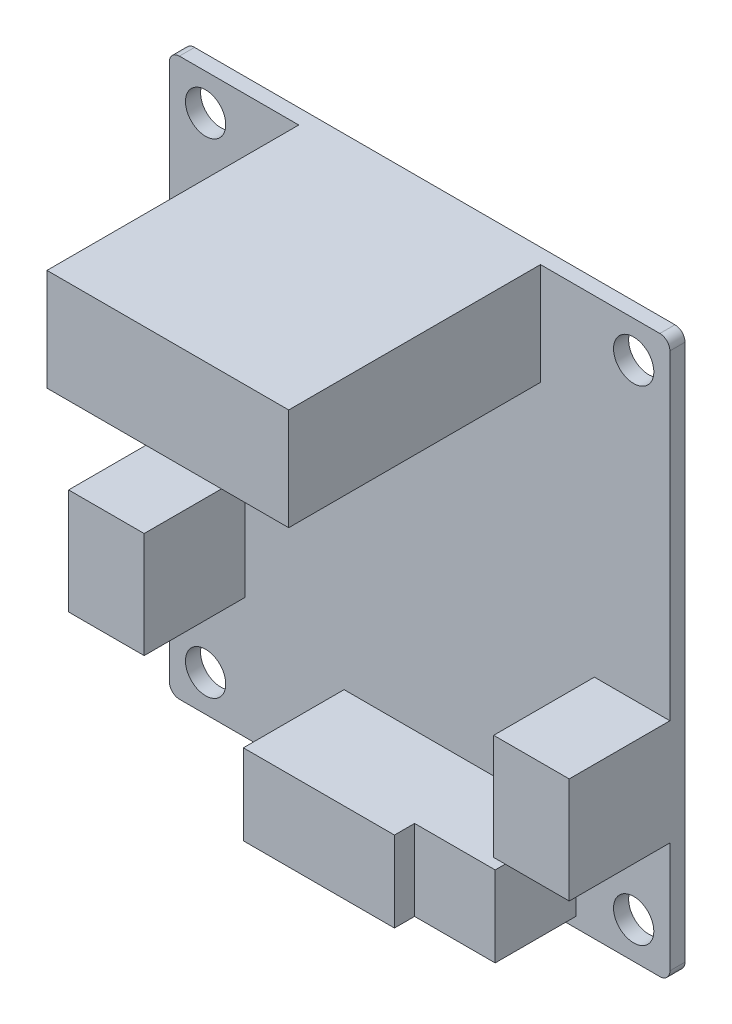
ISO-10303-21;
HEADER;
FILE_DESCRIPTION(('STEP AP214'),'2;1');
FILE_NAME('part.step','',(''),(''),'','','');
FILE_SCHEMA(('AUTOMOTIVE_DESIGN { 1 0 10303 214 1 1 1 1 }'));
ENDSEC;
DATA;
#1=APPLICATION_CONTEXT('core data for automotive mechanical design processes');
#2=APPLICATION_PROTOCOL_DEFINITION('international standard','automotive_design',2000,#1);
#3=PRODUCT_CONTEXT('',#1,'mechanical');
#4=PRODUCT('Part','Part','',(#3));
#5=PRODUCT_RELATED_PRODUCT_CATEGORY('part','',(#4));
#6=PRODUCT_DEFINITION_FORMATION('','',#4);
#7=PRODUCT_DEFINITION_CONTEXT('part definition',#1,'design');
#8=PRODUCT_DEFINITION('design','',#6,#7);
#9=PRODUCT_DEFINITION_SHAPE('','',#8);
#10=(LENGTH_UNIT() NAMED_UNIT(*) SI_UNIT(.MILLI.,.METRE.));
#11=(NAMED_UNIT(*) PLANE_ANGLE_UNIT() SI_UNIT($,.RADIAN.));
#12=(NAMED_UNIT(*) SI_UNIT($,.STERADIAN.) SOLID_ANGLE_UNIT());
#13=UNCERTAINTY_MEASURE_WITH_UNIT(LENGTH_MEASURE(1.E-05),#10,'distance_accuracy_value','');
#14=(GEOMETRIC_REPRESENTATION_CONTEXT(3) GLOBAL_UNCERTAINTY_ASSIGNED_CONTEXT((#13)) GLOBAL_UNIT_ASSIGNED_CONTEXT((#10,
#11,#12)) REPRESENTATION_CONTEXT('',''));
#15=CARTESIAN_POINT('',(0.,0.,0.));
#16=DIRECTION('',(0.,0.,1.));
#17=DIRECTION('',(1.,0.,0.));
#18=AXIS2_PLACEMENT_3D('',#15,#16,#17);
#19=CARTESIAN_POINT('',(0.,0.,1.5));
#20=DIRECTION('',(0.,0.,-1.));
#21=DIRECTION('',(-1.,0.,0.));
#22=AXIS2_PLACEMENT_3D('',#19,#20,#21);
#23=PLANE('',#22);
#24=CARTESIAN_POINT('',(3.6,3.6,1.5));
#25=DIRECTION('',(0.,0.,1.));
#26=DIRECTION('',(-1.,0.,0.));
#27=AXIS2_PLACEMENT_3D('',#24,#25,#26);
#28=CIRCLE('',#27,2.);
#29=CARTESIAN_POINT('',(1.6,3.6,1.5));
#30=VERTEX_POINT('',#29);
#31=EDGE_CURVE('E430',#30,#30,#28,.T.);
#32=ORIENTED_EDGE('',*,*,#31,.F.);
#33=EDGE_LOOP('',(#32));
#34=FACE_BOUND('',#33,.T.);
#35=CARTESIAN_POINT('',(46.1,51.7,1.5));
#36=DIRECTION('',(0.,0.,1.));
#37=DIRECTION('',(-1.,0.,0.));
#38=AXIS2_PLACEMENT_3D('',#35,#36,#37);
#39=CIRCLE('',#38,2.);
#40=CARTESIAN_POINT('',(44.1,51.7,1.5));
#41=VERTEX_POINT('',#40);
#42=EDGE_CURVE('E418',#41,#41,#39,.T.);
#43=ORIENTED_EDGE('',*,*,#42,.F.);
#44=EDGE_LOOP('',(#43));
#45=FACE_BOUND('',#44,.T.);
#46=CARTESIAN_POINT('',(3.6,51.7,1.5));
#47=DIRECTION('',(0.,0.,1.));
#48=DIRECTION('',(1.,0.,0.));
#49=AXIS2_PLACEMENT_3D('',#46,#47,#48);
#50=CIRCLE('',#49,2.);
#51=CARTESIAN_POINT('',(5.6,51.7,1.5));
#52=VERTEX_POINT('',#51);
#53=EDGE_CURVE('E352',#52,#52,#50,.T.);
#54=ORIENTED_EDGE('',*,*,#53,.F.);
#55=EDGE_LOOP('',(#54));
#56=FACE_BOUND('',#55,.T.);
#57=CARTESIAN_POINT('',(46.1,3.6,1.5));
#58=DIRECTION('',(0.,0.,1.));
#59=DIRECTION('',(1.,0.,0.));
#60=AXIS2_PLACEMENT_3D('',#57,#58,#59);
#61=CIRCLE('',#60,2.);
#62=CARTESIAN_POINT('',(48.1,3.6,1.5));
#63=VERTEX_POINT('',#62);
#64=EDGE_CURVE('E424',#63,#63,#61,.T.);
#65=ORIENTED_EDGE('',*,*,#64,.F.);
#66=EDGE_LOOP('',(#65));
#67=FACE_BOUND('',#66,.T.);
#68=DIRECTION('',(1.,0.,0.));
#69=VECTOR('',#68,1.);
#70=CARTESIAN_POINT('',(49.7,12.,1.5));
#71=LINE('',#70,#69);
#72=CARTESIAN_POINT('',(42.2,12.,1.5));
#73=VERTEX_POINT('',#72);
#74=CARTESIAN_POINT('',(49.7,12.,1.5));
#75=VERTEX_POINT('',#74);
#76=EDGE_CURVE('E58',#73,#75,#71,.T.);
#77=ORIENTED_EDGE('',*,*,#76,.F.);
#78=DIRECTION('',(0.,-1.,0.));
#79=VECTOR('',#78,1.);
#80=CARTESIAN_POINT('',(42.2,12.,1.5));
#81=LINE('',#80,#79);
#82=CARTESIAN_POINT('',(42.2,22.5,1.5));
#83=VERTEX_POINT('',#82);
#84=EDGE_CURVE('E244',#83,#73,#81,.T.);
#85=ORIENTED_EDGE('',*,*,#84,.F.);
#86=DIRECTION('',(-1.,0.,0.));
#87=VECTOR('',#86,1.);
#88=CARTESIAN_POINT('',(49.7,22.5,1.5));
#89=LINE('',#88,#87);
#90=CARTESIAN_POINT('',(49.7,22.5,1.5));
#91=VERTEX_POINT('',#90);
#92=EDGE_CURVE('E252',#91,#83,#89,.T.);
#93=ORIENTED_EDGE('',*,*,#92,.F.);
#94=DIRECTION('',(0.,1.,0.));
#95=VECTOR('',#94,1.);
#96=CARTESIAN_POINT('',(49.7,0.,1.5));
#97=LINE('',#96,#95);
#98=CARTESIAN_POINT('',(49.7,54.3,1.5));
#99=VERTEX_POINT('',#98);
#100=EDGE_CURVE('E413',#91,#99,#97,.T.);
#101=ORIENTED_EDGE('',*,*,#100,.T.);
#102=CARTESIAN_POINT('',(48.7,54.3,1.5));
#103=DIRECTION('',(0.,0.,-1.));
#104=DIRECTION('',(-1.,0.,0.));
#105=AXIS2_PLACEMENT_3D('',#102,#103,#104);
#106=CIRCLE('',#105,1.);
#107=CARTESIAN_POINT('',(48.7,55.3,1.5));
#108=VERTEX_POINT('',#107);
#109=EDGE_CURVE('E383',#99,#108,#106,.F.);
#110=ORIENTED_EDGE('',*,*,#109,.T.);
#111=DIRECTION('',(-1.,0.,0.));
#112=VECTOR('',#111,1.);
#113=CARTESIAN_POINT('',(0.,55.3,1.5));
#114=LINE('',#113,#112);
#115=CARTESIAN_POINT('',(36.85,55.3,1.5));
#116=VERTEX_POINT('',#115);
#117=EDGE_CURVE('E341',#108,#116,#114,.T.);
#118=ORIENTED_EDGE('',*,*,#117,.T.);
#119=DIRECTION('',(0.,1.,0.));
#120=VECTOR('',#119,1.);
#121=CARTESIAN_POINT('',(36.85,45.172543808363,1.5));
#122=LINE('',#121,#120);
#123=CARTESIAN_POINT('',(36.85,45.172543808363,1.5));
#124=VERTEX_POINT('',#123);
#125=EDGE_CURVE('E302',#124,#116,#122,.T.);
#126=ORIENTED_EDGE('',*,*,#125,.F.);
#127=DIRECTION('',(1.,0.,0.));
#128=VECTOR('',#127,1.);
#129=CARTESIAN_POINT('',(12.85,45.172543808363,1.5));
#130=LINE('',#129,#128);
#131=CARTESIAN_POINT('',(12.85,45.172543808363,1.5));
#132=VERTEX_POINT('',#131);
#133=EDGE_CURVE('E309',#132,#124,#130,.T.);
#134=ORIENTED_EDGE('',*,*,#133,.F.);
#135=DIRECTION('',(0.,-1.,0.));
#136=VECTOR('',#135,1.);
#137=CARTESIAN_POINT('',(12.85,45.172543808363,1.5));
#138=LINE('',#137,#136);
#139=CARTESIAN_POINT('',(12.85,55.3,1.5));
#140=VERTEX_POINT('',#139);
#141=EDGE_CURVE('E297',#140,#132,#138,.T.);
#142=ORIENTED_EDGE('',*,*,#141,.F.);
#143=CARTESIAN_POINT('',(1.,55.3,1.5));
#144=VERTEX_POINT('',#143);
#145=EDGE_CURVE('E338',#140,#144,#114,.T.);
#146=ORIENTED_EDGE('',*,*,#145,.T.);
#147=CARTESIAN_POINT('',(1.,54.3,1.5));
#148=DIRECTION('',(0.,0.,-1.));
#149=DIRECTION('',(-1.,0.,0.));
#150=AXIS2_PLACEMENT_3D('',#147,#148,#149);
#151=CIRCLE('',#150,1.);
#152=CARTESIAN_POINT('',(0.,54.3,1.5));
#153=VERTEX_POINT('',#152);
#154=EDGE_CURVE('E381',#144,#153,#151,.F.);
#155=ORIENTED_EDGE('',*,*,#154,.T.);
#156=DIRECTION('',(0.,-1.,0.));
#157=VECTOR('',#156,1.);
#158=CARTESIAN_POINT('',(0.,0.,1.5));
#159=LINE('',#158,#157);
#160=CARTESIAN_POINT('',(0.,22.5,1.5));
#161=VERTEX_POINT('',#160);
#162=EDGE_CURVE('E404',#153,#161,#159,.T.);
#163=ORIENTED_EDGE('',*,*,#162,.T.);
#164=DIRECTION('',(-1.,0.,0.));
#165=VECTOR('',#164,1.);
#166=CARTESIAN_POINT('',(0.,22.5,1.5));
#167=LINE('',#166,#165);
#168=CARTESIAN_POINT('',(7.5,22.5,1.5));
#169=VERTEX_POINT('',#168);
#170=EDGE_CURVE('E272',#169,#161,#167,.T.);
#171=ORIENTED_EDGE('',*,*,#170,.F.);
#172=DIRECTION('',(0.,1.,0.));
#173=VECTOR('',#172,1.);
#174=CARTESIAN_POINT('',(7.5,12.,1.5));
#175=LINE('',#174,#173);
#176=CARTESIAN_POINT('',(7.5,12.,1.5));
#177=VERTEX_POINT('',#176);
#178=EDGE_CURVE('E281',#177,#169,#175,.T.);
#179=ORIENTED_EDGE('',*,*,#178,.F.);
#180=DIRECTION('',(1.,0.,0.));
#181=VECTOR('',#180,1.);
#182=CARTESIAN_POINT('',(0.,12.,1.5));
#183=LINE('',#182,#181);
#184=CARTESIAN_POINT('',(0.,12.,1.5));
#185=VERTEX_POINT('',#184);
#186=EDGE_CURVE('E267',#185,#177,#183,.T.);
#187=ORIENTED_EDGE('',*,*,#186,.F.);
#188=CARTESIAN_POINT('',(0.,1.,1.5));
#189=VERTEX_POINT('',#188);
#190=EDGE_CURVE('E361',#185,#189,#159,.T.);
#191=ORIENTED_EDGE('',*,*,#190,.T.);
#192=CARTESIAN_POINT('',(1.,1.,1.5));
#193=DIRECTION('',(0.,0.,-1.));
#194=DIRECTION('',(-1.,0.,0.));
#195=AXIS2_PLACEMENT_3D('',#192,#193,#194);
#196=CIRCLE('',#195,1.);
#197=CARTESIAN_POINT('',(1.,0.,1.5));
#198=VERTEX_POINT('',#197);
#199=EDGE_CURVE('E387',#189,#198,#196,.F.);
#200=ORIENTED_EDGE('',*,*,#199,.T.);
#201=DIRECTION('',(1.,0.,0.));
#202=VECTOR('',#201,1.);
#203=CARTESIAN_POINT('',(0.,0.,1.5));
#204=LINE('',#203,#202);
#205=CARTESIAN_POINT('',(48.7,0.,1.5));
#206=VERTEX_POINT('',#205);
#207=EDGE_CURVE('E410',#198,#206,#204,.T.);
#208=ORIENTED_EDGE('',*,*,#207,.T.);
#209=CARTESIAN_POINT('',(48.7,1.,1.5));
#210=DIRECTION('',(0.,0.,-1.));
#211=DIRECTION('',(-1.,0.,0.));
#212=AXIS2_PLACEMENT_3D('',#209,#210,#211);
#213=CIRCLE('',#212,1.);
#214=CARTESIAN_POINT('',(49.7,1.,1.5));
#215=VERTEX_POINT('',#214);
#216=EDGE_CURVE('E385',#206,#215,#213,.F.);
#217=ORIENTED_EDGE('',*,*,#216,.T.);
#218=EDGE_CURVE('E342',#215,#75,#97,.T.);
#219=ORIENTED_EDGE('',*,*,#218,.T.);
#220=EDGE_LOOP('',(#77,#85,#93,#101,#110,#118,#126,#134,#142,#146,#155,#163,#171,#179,#187,#191,
#200,#208,#217,#219));
#221=FACE_BOUND('',#220,.T.);
#222=DIRECTION('',(0.,1.,0.));
#223=VECTOR('',#222,1.);
#224=CARTESIAN_POINT('',(40.35,0.999999999999999,1.5));
#225=LINE('',#224,#223);
#226=CARTESIAN_POINT('',(40.35,0.999999999999999,1.5));
#227=VERTEX_POINT('',#226);
#228=CARTESIAN_POINT('',(40.35,9.,1.5));
#229=VERTEX_POINT('',#228);
#230=EDGE_CURVE('E228',#227,#229,#225,.T.);
#231=ORIENTED_EDGE('',*,*,#230,.F.);
#232=DIRECTION('',(1.,0.,0.));
#233=VECTOR('',#232,1.);
#234=CARTESIAN_POINT('',(17.35,0.999999999999999,1.5));
#235=LINE('',#234,#233);
#236=CARTESIAN_POINT('',(17.35,0.999999999999999,1.5));
#237=VERTEX_POINT('',#236);
#238=EDGE_CURVE('E50',#237,#227,#235,.T.);
#239=ORIENTED_EDGE('',*,*,#238,.F.);
#240=DIRECTION('',(0.,-1.,0.));
#241=VECTOR('',#240,1.);
#242=CARTESIAN_POINT('',(17.35,0.999999999999999,1.5));
#243=LINE('',#242,#241);
#244=CARTESIAN_POINT('',(17.35,9.,1.5));
#245=VERTEX_POINT('',#244);
#246=EDGE_CURVE('E670',#245,#237,#243,.T.);
#247=ORIENTED_EDGE('',*,*,#246,.F.);
#248=DIRECTION('',(-1.,0.,0.));
#249=VECTOR('',#248,1.);
#250=CARTESIAN_POINT('',(17.35,9.,1.5));
#251=LINE('',#250,#249);
#252=EDGE_CURVE('E667',#229,#245,#251,.T.);
#253=ORIENTED_EDGE('',*,*,#252,.F.);
#254=EDGE_LOOP('',(#231,#239,#247,#253));
#255=FACE_BOUND('',#254,.T.);
#256=ADVANCED_FACE('F33',(#34,#45,#56,#67,#221,#255),#23,.F.);
#257=CARTESIAN_POINT('',(32.35,0.999999999999999,11.5));
#258=DIRECTION('',(-1.,0.,0.));
#259=DIRECTION('',(0.,0.,1.));
#260=AXIS2_PLACEMENT_3D('',#257,#258,#259);
#261=PLANE('',#260);
#262=DIRECTION('',(0.,-1.,0.));
#263=VECTOR('',#262,1.);
#264=CARTESIAN_POINT('',(32.35,0.999999999999999,9.5));
#265=LINE('',#264,#263);
#266=CARTESIAN_POINT('',(32.35,9.,9.5));
#267=VERTEX_POINT('',#266);
#268=CARTESIAN_POINT('',(32.35,0.999999999999999,9.5));
#269=VERTEX_POINT('',#268);
#270=EDGE_CURVE('E219',#267,#269,#265,.T.);
#271=ORIENTED_EDGE('',*,*,#270,.F.);
#272=DIRECTION('',(0.,0.,-1.));
#273=VECTOR('',#272,1.);
#274=CARTESIAN_POINT('',(32.35,9.,11.5));
#275=LINE('',#274,#273);
#276=CARTESIAN_POINT('',(32.35,9.,11.5));
#277=VERTEX_POINT('',#276);
#278=EDGE_CURVE('E233',#277,#267,#275,.T.);
#279=ORIENTED_EDGE('',*,*,#278,.F.);
#280=DIRECTION('',(0.,1.,0.));
#281=VECTOR('',#280,1.);
#282=CARTESIAN_POINT('',(32.35,0.999999999999999,11.5));
#283=LINE('',#282,#281);
#284=CARTESIAN_POINT('',(32.35,0.999999999999999,11.5));
#285=VERTEX_POINT('',#284);
#286=EDGE_CURVE('E231',#285,#277,#283,.T.);
#287=ORIENTED_EDGE('',*,*,#286,.F.);
#288=DIRECTION('',(0.,0.,-1.));
#289=VECTOR('',#288,1.);
#290=CARTESIAN_POINT('',(32.35,0.999999999999999,11.5));
#291=LINE('',#290,#289);
#292=EDGE_CURVE('E212',#285,#269,#291,.T.);
#293=ORIENTED_EDGE('',*,*,#292,.T.);
#294=EDGE_LOOP('',(#271,#279,#287,#293));
#295=FACE_BOUND('',#294,.T.);
#296=ADVANCED_FACE('F230',(#295),#261,.F.);
#297=CARTESIAN_POINT('',(0.,0.,0.));
#298=DIRECTION('',(0.,0.,-1.));
#299=DIRECTION('',(-1.,0.,0.));
#300=AXIS2_PLACEMENT_3D('',#297,#298,#299);
#301=PLANE('',#300);
#302=CARTESIAN_POINT('',(46.1,3.6,0.));
#303=DIRECTION('',(0.,0.,1.));
#304=DIRECTION('',(1.,0.,0.));
#305=AXIS2_PLACEMENT_3D('',#302,#303,#304);
#306=CIRCLE('',#305,2.);
#307=CARTESIAN_POINT('',(48.1,3.6,0.));
#308=VERTEX_POINT('',#307);
#309=EDGE_CURVE('E427',#308,#308,#306,.T.);
#310=ORIENTED_EDGE('',*,*,#309,.T.);
#311=EDGE_LOOP('',(#310));
#312=FACE_BOUND('',#311,.T.);
#313=CARTESIAN_POINT('',(3.6,51.7,0.));
#314=DIRECTION('',(0.,0.,1.));
#315=DIRECTION('',(1.,0.,0.));
#316=AXIS2_PLACEMENT_3D('',#313,#314,#315);
#317=CIRCLE('',#316,2.);
#318=CARTESIAN_POINT('',(5.6,51.7,0.));
#319=VERTEX_POINT('',#318);
#320=EDGE_CURVE('E415',#319,#319,#317,.T.);
#321=ORIENTED_EDGE('',*,*,#320,.T.);
#322=EDGE_LOOP('',(#321));
#323=FACE_BOUND('',#322,.T.);
#324=DIRECTION('',(1.,0.,0.));
#325=VECTOR('',#324,1.);
#326=CARTESIAN_POINT('',(0.,0.,0.));
#327=LINE('',#326,#325);
#328=CARTESIAN_POINT('',(1.,0.,0.));
#329=VERTEX_POINT('',#328);
#330=CARTESIAN_POINT('',(48.7,0.,0.));
#331=VERTEX_POINT('',#330);
#332=EDGE_CURVE('E351',#329,#331,#327,.T.);
#333=ORIENTED_EDGE('',*,*,#332,.F.);
#334=CARTESIAN_POINT('',(1.,1.,0.));
#335=DIRECTION('',(0.,0.,-1.));
#336=DIRECTION('',(-1.,0.,0.));
#337=AXIS2_PLACEMENT_3D('',#334,#335,#336);
#338=CIRCLE('',#337,1.);
#339=CARTESIAN_POINT('',(0.,1.,0.));
#340=VERTEX_POINT('',#339);
#341=EDGE_CURVE('E373',#329,#340,#338,.T.);
#342=ORIENTED_EDGE('',*,*,#341,.T.);
#343=DIRECTION('',(0.,-1.,0.));
#344=VECTOR('',#343,1.);
#345=CARTESIAN_POINT('',(0.,0.,0.));
#346=LINE('',#345,#344);
#347=CARTESIAN_POINT('',(0.,54.3,0.));
#348=VERTEX_POINT('',#347);
#349=EDGE_CURVE('E347',#348,#340,#346,.T.);
#350=ORIENTED_EDGE('',*,*,#349,.F.);
#351=CARTESIAN_POINT('',(1.,54.3,0.));
#352=DIRECTION('',(0.,0.,-1.));
#353=DIRECTION('',(-1.,0.,0.));
#354=AXIS2_PLACEMENT_3D('',#351,#352,#353);
#355=CIRCLE('',#354,1.);
#356=CARTESIAN_POINT('',(1.,55.3,0.));
#357=VERTEX_POINT('',#356);
#358=EDGE_CURVE('E367',#348,#357,#355,.T.);
#359=ORIENTED_EDGE('',*,*,#358,.T.);
#360=DIRECTION('',(-1.,0.,0.));
#361=VECTOR('',#360,1.);
#362=CARTESIAN_POINT('',(0.,55.3,0.));
#363=LINE('',#362,#361);
#364=CARTESIAN_POINT('',(48.7,55.3,0.));
#365=VERTEX_POINT('',#364);
#366=EDGE_CURVE('E358',#365,#357,#363,.T.);
#367=ORIENTED_EDGE('',*,*,#366,.F.);
#368=CARTESIAN_POINT('',(48.7,54.3,0.));
#369=DIRECTION('',(0.,0.,-1.));
#370=DIRECTION('',(-1.,0.,0.));
#371=AXIS2_PLACEMENT_3D('',#368,#369,#370);
#372=CIRCLE('',#371,1.);
#373=CARTESIAN_POINT('',(49.7,54.3,0.));
#374=VERTEX_POINT('',#373);
#375=EDGE_CURVE('E369',#365,#374,#372,.T.);
#376=ORIENTED_EDGE('',*,*,#375,.T.);
#377=DIRECTION('',(0.,1.,0.));
#378=VECTOR('',#377,1.);
#379=CARTESIAN_POINT('',(49.7,0.,0.));
#380=LINE('',#379,#378);
#381=CARTESIAN_POINT('',(49.7,1.,0.));
#382=VERTEX_POINT('',#381);
#383=EDGE_CURVE('E355',#382,#374,#380,.T.);
#384=ORIENTED_EDGE('',*,*,#383,.F.);
#385=CARTESIAN_POINT('',(48.7,1.,0.));
#386=DIRECTION('',(0.,0.,-1.));
#387=DIRECTION('',(-1.,0.,0.));
#388=AXIS2_PLACEMENT_3D('',#385,#386,#387);
#389=CIRCLE('',#388,1.);
#390=EDGE_CURVE('E371',#382,#331,#389,.T.);
#391=ORIENTED_EDGE('',*,*,#390,.T.);
#392=EDGE_LOOP('',(#333,#342,#350,#359,#367,#376,#384,#391));
#393=FACE_BOUND('',#392,.T.);
#394=CARTESIAN_POINT('',(46.1,51.7,0.));
#395=DIRECTION('',(0.,0.,1.));
#396=DIRECTION('',(-1.,0.,0.));
#397=AXIS2_PLACEMENT_3D('',#394,#395,#396);
#398=CIRCLE('',#397,2.);
#399=CARTESIAN_POINT('',(44.1,51.7,0.));
#400=VERTEX_POINT('',#399);
#401=EDGE_CURVE('E421',#400,#400,#398,.T.);
#402=ORIENTED_EDGE('',*,*,#401,.T.);
#403=EDGE_LOOP('',(#402));
#404=FACE_BOUND('',#403,.T.);
#405=CARTESIAN_POINT('',(3.6,3.6,0.));
#406=DIRECTION('',(0.,0.,1.));
#407=DIRECTION('',(-1.,0.,0.));
#408=AXIS2_PLACEMENT_3D('',#405,#406,#407);
#409=CIRCLE('',#408,2.);
#410=CARTESIAN_POINT('',(1.6,3.6,0.));
#411=VERTEX_POINT('',#410);
#412=EDGE_CURVE('E433',#411,#411,#409,.T.);
#413=ORIENTED_EDGE('',*,*,#412,.T.);
#414=EDGE_LOOP('',(#413));
#415=FACE_BOUND('',#414,.T.);
#416=ADVANCED_FACE('F465',(#312,#323,#393,#404,#415),#301,.T.);
#417=CARTESIAN_POINT('',(0.,0.,1.5));
#418=DIRECTION('',(1.,0.,0.));
#419=DIRECTION('',(0.,0.,-1.));
#420=AXIS2_PLACEMENT_3D('',#417,#418,#419);
#421=PLANE('',#420);
#422=ORIENTED_EDGE('',*,*,#349,.T.);
#423=DIRECTION('',(0.,0.,-1.));
#424=VECTOR('',#423,1.);
#425=CARTESIAN_POINT('',(0.,1.,1.5));
#426=LINE('',#425,#424);
#427=EDGE_CURVE('E378',#340,#189,#426,.F.);
#428=ORIENTED_EDGE('',*,*,#427,.T.);
#429=ORIENTED_EDGE('',*,*,#190,.F.);
#430=DIRECTION('',(0.,0.,-1.));
#431=VECTOR('',#430,1.);
#432=CARTESIAN_POINT('',(0.,12.,11.5));
#433=LINE('',#432,#431);
#434=CARTESIAN_POINT('',(0.,12.,11.5));
#435=VERTEX_POINT('',#434);
#436=EDGE_CURVE('E294',#435,#185,#433,.T.);
#437=ORIENTED_EDGE('',*,*,#436,.F.);
#438=DIRECTION('',(0.,-1.,0.));
#439=VECTOR('',#438,1.);
#440=CARTESIAN_POINT('',(0.,12.,11.5));
#441=LINE('',#440,#439);
#442=CARTESIAN_POINT('',(0.,22.5,11.5));
#443=VERTEX_POINT('',#442);
#444=EDGE_CURVE('E268',#443,#435,#441,.T.);
#445=ORIENTED_EDGE('',*,*,#444,.F.);
#446=DIRECTION('',(0.,0.,-1.));
#447=VECTOR('',#446,1.);
#448=CARTESIAN_POINT('',(0.,22.5,11.5));
#449=LINE('',#448,#447);
#450=EDGE_CURVE('E278',#443,#161,#449,.T.);
#451=ORIENTED_EDGE('',*,*,#450,.T.);
#452=ORIENTED_EDGE('',*,*,#162,.F.);
#453=DIRECTION('',(0.,0.,-1.));
#454=VECTOR('',#453,1.);
#455=CARTESIAN_POINT('',(0.,54.3,1.5));
#456=LINE('',#455,#454);
#457=EDGE_CURVE('E375',#153,#348,#456,.T.);
#458=ORIENTED_EDGE('',*,*,#457,.T.);
#459=EDGE_LOOP('',(#422,#428,#429,#437,#445,#451,#452,#458));
#460=FACE_BOUND('',#459,.T.);
#461=ADVANCED_FACE('F406',(#460),#421,.F.);
#462=CARTESIAN_POINT('',(0.,0.,1.5));
#463=DIRECTION('',(0.,1.,0.));
#464=DIRECTION('',(0.,0.,1.));
#465=AXIS2_PLACEMENT_3D('',#462,#463,#464);
#466=PLANE('',#465);
#467=ORIENTED_EDGE('',*,*,#207,.F.);
#468=DIRECTION('',(0.,0.,-1.));
#469=VECTOR('',#468,1.);
#470=CARTESIAN_POINT('',(1.,0.,1.5));
#471=LINE('',#470,#469);
#472=EDGE_CURVE('E364',#198,#329,#471,.T.);
#473=ORIENTED_EDGE('',*,*,#472,.T.);
#474=ORIENTED_EDGE('',*,*,#332,.T.);
#475=DIRECTION('',(0.,0.,-1.));
#476=VECTOR('',#475,1.);
#477=CARTESIAN_POINT('',(48.7,0.,1.5));
#478=LINE('',#477,#476);
#479=EDGE_CURVE('E362',#331,#206,#478,.F.);
#480=ORIENTED_EDGE('',*,*,#479,.T.);
#481=EDGE_LOOP('',(#467,#473,#474,#480));
#482=FACE_BOUND('',#481,.T.);
#483=ADVANCED_FACE('F481',(#482),#466,.F.);
#484=CARTESIAN_POINT('',(49.7,0.,1.5));
#485=DIRECTION('',(-1.,0.,0.));
#486=DIRECTION('',(0.,0.,1.));
#487=AXIS2_PLACEMENT_3D('',#484,#485,#486);
#488=PLANE('',#487);
#489=ORIENTED_EDGE('',*,*,#218,.F.);
#490=DIRECTION('',(0.,0.,-1.));
#491=VECTOR('',#490,1.);
#492=CARTESIAN_POINT('',(49.7,1.,1.5));
#493=LINE('',#492,#491);
#494=EDGE_CURVE('E392',#215,#382,#493,.T.);
#495=ORIENTED_EDGE('',*,*,#494,.T.);
#496=ORIENTED_EDGE('',*,*,#383,.T.);
#497=DIRECTION('',(0.,0.,-1.));
#498=VECTOR('',#497,1.);
#499=CARTESIAN_POINT('',(49.7,54.3,1.5));
#500=LINE('',#499,#498);
#501=EDGE_CURVE('E389',#374,#99,#500,.F.);
#502=ORIENTED_EDGE('',*,*,#501,.T.);
#503=ORIENTED_EDGE('',*,*,#100,.F.);
#504=DIRECTION('',(0.,0.,-1.));
#505=VECTOR('',#504,1.);
#506=CARTESIAN_POINT('',(49.7,22.5,11.5));
#507=LINE('',#506,#505);
#508=CARTESIAN_POINT('',(49.7,22.5,11.5));
#509=VERTEX_POINT('',#508);
#510=EDGE_CURVE('E261',#509,#91,#507,.T.);
#511=ORIENTED_EDGE('',*,*,#510,.F.);
#512=DIRECTION('',(0.,1.,0.));
#513=VECTOR('',#512,1.);
#514=CARTESIAN_POINT('',(49.7,12.,11.5));
#515=LINE('',#514,#513);
#516=CARTESIAN_POINT('',(49.7,12.,11.5));
#517=VERTEX_POINT('',#516);
#518=EDGE_CURVE('E243',#517,#509,#515,.T.);
#519=ORIENTED_EDGE('',*,*,#518,.F.);
#520=DIRECTION('',(0.,0.,-1.));
#521=VECTOR('',#520,1.);
#522=CARTESIAN_POINT('',(49.7,12.,11.5));
#523=LINE('',#522,#521);
#524=EDGE_CURVE('E264',#517,#75,#523,.T.);
#525=ORIENTED_EDGE('',*,*,#524,.T.);
#526=EDGE_LOOP('',(#489,#495,#496,#502,#503,#511,#519,#525));
#527=FACE_BOUND('',#526,.T.);
#528=ADVANCED_FACE('F478',(#527),#488,.F.);
#529=CARTESIAN_POINT('',(0.,55.3,1.5));
#530=DIRECTION('',(0.,-1.,0.));
#531=DIRECTION('',(0.,0.,-1.));
#532=AXIS2_PLACEMENT_3D('',#529,#530,#531);
#533=PLANE('',#532);
#534=ORIENTED_EDGE('',*,*,#117,.F.);
#535=DIRECTION('',(0.,0.,-1.));
#536=VECTOR('',#535,1.);
#537=CARTESIAN_POINT('',(48.7,55.3,1.5));
#538=LINE('',#537,#536);
#539=EDGE_CURVE('E11',#108,#365,#538,.T.);
#540=ORIENTED_EDGE('',*,*,#539,.T.);
#541=ORIENTED_EDGE('',*,*,#366,.T.);
#542=DIRECTION('',(0.,0.,-1.));
#543=VECTOR('',#542,1.);
#544=CARTESIAN_POINT('',(1.,55.3,1.5));
#545=LINE('',#544,#543);
#546=EDGE_CURVE('E42',#357,#144,#545,.F.);
#547=ORIENTED_EDGE('',*,*,#546,.T.);
#548=ORIENTED_EDGE('',*,*,#145,.F.);
#549=DIRECTION('',(0.,0.,-1.));
#550=VECTOR('',#549,1.);
#551=CARTESIAN_POINT('',(12.85,55.3,26.5));
#552=LINE('',#551,#550);
#553=CARTESIAN_POINT('',(12.85,55.3,26.5));
#554=VERTEX_POINT('',#553);
#555=EDGE_CURVE('E308',#554,#140,#552,.T.);
#556=ORIENTED_EDGE('',*,*,#555,.F.);
#557=DIRECTION('',(-1.,0.,0.));
#558=VECTOR('',#557,1.);
#559=CARTESIAN_POINT('',(12.85,55.3,26.5));
#560=LINE('',#559,#558);
#561=CARTESIAN_POINT('',(36.85,55.3,26.5));
#562=VERTEX_POINT('',#561);
#563=EDGE_CURVE('E306',#562,#554,#560,.T.);
#564=ORIENTED_EDGE('',*,*,#563,.F.);
#565=DIRECTION('',(0.,0.,-1.));
#566=VECTOR('',#565,1.);
#567=CARTESIAN_POINT('',(36.85,55.3,26.5));
#568=LINE('',#567,#566);
#569=EDGE_CURVE('E321',#562,#116,#568,.T.);
#570=ORIENTED_EDGE('',*,*,#569,.T.);
#571=EDGE_LOOP('',(#534,#540,#541,#547,#548,#556,#564,#570));
#572=FACE_BOUND('',#571,.T.);
#573=ADVANCED_FACE('F399',(#572),#533,.F.);
#574=CARTESIAN_POINT('',(3.6,51.7,1.5));
#575=DIRECTION('',(0.,0.,-1.));
#576=DIRECTION('',(-1.,0.,0.));
#577=AXIS2_PLACEMENT_3D('',#574,#575,#576);
#578=CYLINDRICAL_SURFACE('',#577,2.);
#579=ORIENTED_EDGE('',*,*,#53,.T.);
#580=EDGE_LOOP('',(#579));
#581=FACE_BOUND('',#580,.T.);
#582=ORIENTED_EDGE('',*,*,#320,.F.);
#583=EDGE_LOOP('',(#582));
#584=FACE_BOUND('',#583,.T.);
#585=ADVANCED_FACE('F471',(#581,#584),#578,.F.);
#586=CARTESIAN_POINT('',(46.1,51.7,1.5));
#587=DIRECTION('',(0.,0.,-1.));
#588=DIRECTION('',(-1.,0.,0.));
#589=AXIS2_PLACEMENT_3D('',#586,#587,#588);
#590=CYLINDRICAL_SURFACE('',#589,2.);
#591=ORIENTED_EDGE('',*,*,#42,.T.);
#592=EDGE_LOOP('',(#591));
#593=FACE_BOUND('',#592,.T.);
#594=ORIENTED_EDGE('',*,*,#401,.F.);
#595=EDGE_LOOP('',(#594));
#596=FACE_BOUND('',#595,.T.);
#597=ADVANCED_FACE('F721',(#593,#596),#590,.F.);
#598=CARTESIAN_POINT('',(46.1,3.6,1.5));
#599=DIRECTION('',(0.,0.,-1.));
#600=DIRECTION('',(-1.,0.,0.));
#601=AXIS2_PLACEMENT_3D('',#598,#599,#600);
#602=CYLINDRICAL_SURFACE('',#601,2.);
#603=ORIENTED_EDGE('',*,*,#64,.T.);
#604=EDGE_LOOP('',(#603));
#605=FACE_BOUND('',#604,.T.);
#606=ORIENTED_EDGE('',*,*,#309,.F.);
#607=EDGE_LOOP('',(#606));
#608=FACE_BOUND('',#607,.T.);
#609=ADVANCED_FACE('F728',(#605,#608),#602,.F.);
#610=CARTESIAN_POINT('',(3.6,3.6,1.5));
#611=DIRECTION('',(0.,0.,-1.));
#612=DIRECTION('',(-1.,0.,0.));
#613=AXIS2_PLACEMENT_3D('',#610,#611,#612);
#614=CYLINDRICAL_SURFACE('',#613,2.);
#615=ORIENTED_EDGE('',*,*,#31,.T.);
#616=EDGE_LOOP('',(#615));
#617=FACE_BOUND('',#616,.T.);
#618=ORIENTED_EDGE('',*,*,#412,.F.);
#619=EDGE_LOOP('',(#618));
#620=FACE_BOUND('',#619,.T.);
#621=ADVANCED_FACE('F492',(#617,#620),#614,.F.);
#622=CARTESIAN_POINT('',(1.,1.,1.5));
#623=DIRECTION('',(0.,0.,-1.));
#624=DIRECTION('',(-1.,0.,0.));
#625=AXIS2_PLACEMENT_3D('',#622,#623,#624);
#626=CYLINDRICAL_SURFACE('',#625,1.);
#627=ORIENTED_EDGE('',*,*,#199,.F.);
#628=ORIENTED_EDGE('',*,*,#427,.F.);
#629=ORIENTED_EDGE('',*,*,#341,.F.);
#630=ORIENTED_EDGE('',*,*,#472,.F.);
#631=EDGE_LOOP('',(#627,#628,#629,#630));
#632=FACE_BOUND('',#631,.T.);
#633=ADVANCED_FACE('F488',(#632),#626,.T.);
#634=CARTESIAN_POINT('',(48.7,1.,1.5));
#635=DIRECTION('',(0.,0.,-1.));
#636=DIRECTION('',(-1.,0.,0.));
#637=AXIS2_PLACEMENT_3D('',#634,#635,#636);
#638=CYLINDRICAL_SURFACE('',#637,1.);
#639=ORIENTED_EDGE('',*,*,#216,.F.);
#640=ORIENTED_EDGE('',*,*,#479,.F.);
#641=ORIENTED_EDGE('',*,*,#390,.F.);
#642=ORIENTED_EDGE('',*,*,#494,.F.);
#643=EDGE_LOOP('',(#639,#640,#641,#642));
#644=FACE_BOUND('',#643,.T.);
#645=ADVANCED_FACE('F491',(#644),#638,.T.);
#646=CARTESIAN_POINT('',(48.7,54.3,1.5));
#647=DIRECTION('',(0.,0.,-1.));
#648=DIRECTION('',(-1.,0.,0.));
#649=AXIS2_PLACEMENT_3D('',#646,#647,#648);
#650=CYLINDRICAL_SURFACE('',#649,1.);
#651=ORIENTED_EDGE('',*,*,#109,.F.);
#652=ORIENTED_EDGE('',*,*,#501,.F.);
#653=ORIENTED_EDGE('',*,*,#375,.F.);
#654=ORIENTED_EDGE('',*,*,#539,.F.);
#655=EDGE_LOOP('',(#651,#652,#653,#654));
#656=FACE_BOUND('',#655,.T.);
#657=ADVANCED_FACE('F495',(#656),#650,.T.);
#658=CARTESIAN_POINT('',(1.,54.3,1.5));
#659=DIRECTION('',(0.,0.,-1.));
#660=DIRECTION('',(-1.,0.,0.));
#661=AXIS2_PLACEMENT_3D('',#658,#659,#660);
#662=CYLINDRICAL_SURFACE('',#661,1.);
#663=ORIENTED_EDGE('',*,*,#154,.F.);
#664=ORIENTED_EDGE('',*,*,#546,.F.);
#665=ORIENTED_EDGE('',*,*,#358,.F.);
#666=ORIENTED_EDGE('',*,*,#457,.F.);
#667=EDGE_LOOP('',(#663,#664,#665,#666));
#668=FACE_BOUND('',#667,.T.);
#669=ADVANCED_FACE('F35',(#668),#662,.T.);
#670=CARTESIAN_POINT('',(12.85,45.172543808363,26.5));
#671=DIRECTION('',(1.,0.,0.));
#672=DIRECTION('',(0.,0.,-1.));
#673=AXIS2_PLACEMENT_3D('',#670,#671,#672);
#674=PLANE('',#673);
#675=ORIENTED_EDGE('',*,*,#141,.T.);
#676=DIRECTION('',(0.,0.,-1.));
#677=VECTOR('',#676,1.);
#678=CARTESIAN_POINT('',(12.85,45.172543808363,26.5));
#679=LINE('',#678,#677);
#680=CARTESIAN_POINT('',(12.85,45.172543808363,26.5));
#681=VERTEX_POINT('',#680);
#682=EDGE_CURVE('E328',#681,#132,#679,.T.);
#683=ORIENTED_EDGE('',*,*,#682,.F.);
#684=DIRECTION('',(0.,-1.,0.));
#685=VECTOR('',#684,1.);
#686=CARTESIAN_POINT('',(12.85,45.172543808363,26.5));
#687=LINE('',#686,#685);
#688=EDGE_CURVE('E298',#554,#681,#687,.T.);
#689=ORIENTED_EDGE('',*,*,#688,.F.);
#690=ORIENTED_EDGE('',*,*,#555,.T.);
#691=EDGE_LOOP('',(#675,#683,#689,#690));
#692=FACE_BOUND('',#691,.T.);
#693=ADVANCED_FACE('F442',(#692),#674,.F.);
#694=CARTESIAN_POINT('',(12.85,45.172543808363,26.5));
#695=DIRECTION('',(0.,1.,0.));
#696=DIRECTION('',(0.,0.,1.));
#697=AXIS2_PLACEMENT_3D('',#694,#695,#696);
#698=PLANE('',#697);
#699=ORIENTED_EDGE('',*,*,#133,.T.);
#700=DIRECTION('',(0.,0.,-1.));
#701=VECTOR('',#700,1.);
#702=CARTESIAN_POINT('',(36.85,45.172543808363,26.5));
#703=LINE('',#702,#701);
#704=CARTESIAN_POINT('',(36.85,45.172543808363,26.5));
#705=VERTEX_POINT('',#704);
#706=EDGE_CURVE('E314',#705,#124,#703,.T.);
#707=ORIENTED_EDGE('',*,*,#706,.F.);
#708=DIRECTION('',(1.,0.,0.));
#709=VECTOR('',#708,1.);
#710=CARTESIAN_POINT('',(12.85,45.172543808363,26.5));
#711=LINE('',#710,#709);
#712=EDGE_CURVE('E301',#681,#705,#711,.T.);
#713=ORIENTED_EDGE('',*,*,#712,.F.);
#714=ORIENTED_EDGE('',*,*,#682,.T.);
#715=EDGE_LOOP('',(#699,#707,#713,#714));
#716=FACE_BOUND('',#715,.T.);
#717=ADVANCED_FACE('F440',(#716),#698,.F.);
#718=CARTESIAN_POINT('',(36.85,45.172543808363,26.5));
#719=DIRECTION('',(-1.,0.,0.));
#720=DIRECTION('',(0.,0.,1.));
#721=AXIS2_PLACEMENT_3D('',#718,#719,#720);
#722=PLANE('',#721);
#723=ORIENTED_EDGE('',*,*,#125,.T.);
#724=ORIENTED_EDGE('',*,*,#569,.F.);
#725=DIRECTION('',(0.,1.,0.));
#726=VECTOR('',#725,1.);
#727=CARTESIAN_POINT('',(36.85,45.172543808363,26.5));
#728=LINE('',#727,#726);
#729=EDGE_CURVE('E304',#705,#562,#728,.T.);
#730=ORIENTED_EDGE('',*,*,#729,.F.);
#731=ORIENTED_EDGE('',*,*,#706,.T.);
#732=EDGE_LOOP('',(#723,#724,#730,#731));
#733=FACE_BOUND('',#732,.T.);
#734=ADVANCED_FACE('F444',(#733),#722,.F.);
#735=CARTESIAN_POINT('',(0.,0.,26.5));
#736=DIRECTION('',(0.,0.,-1.));
#737=DIRECTION('',(-1.,0.,0.));
#738=AXIS2_PLACEMENT_3D('',#735,#736,#737);
#739=PLANE('',#738);
#740=ORIENTED_EDGE('',*,*,#688,.T.);
#741=ORIENTED_EDGE('',*,*,#712,.T.);
#742=ORIENTED_EDGE('',*,*,#729,.T.);
#743=ORIENTED_EDGE('',*,*,#563,.T.);
#744=EDGE_LOOP('',(#740,#741,#742,#743));
#745=FACE_BOUND('',#744,.T.);
#746=ADVANCED_FACE('F447',(#745),#739,.F.);
#747=CARTESIAN_POINT('',(0.,12.,11.5));
#748=DIRECTION('',(0.,1.,0.));
#749=DIRECTION('',(-1.,0.,0.));
#750=AXIS2_PLACEMENT_3D('',#747,#748,#749);
#751=PLANE('',#750);
#752=ORIENTED_EDGE('',*,*,#186,.T.);
#753=DIRECTION('',(0.,0.,-1.));
#754=VECTOR('',#753,1.);
#755=CARTESIAN_POINT('',(7.5,12.,11.5));
#756=LINE('',#755,#754);
#757=CARTESIAN_POINT('',(7.5,12.,11.5));
#758=VERTEX_POINT('',#757);
#759=EDGE_CURVE('E291',#758,#177,#756,.T.);
#760=ORIENTED_EDGE('',*,*,#759,.F.);
#761=DIRECTION('',(1.,0.,0.));
#762=VECTOR('',#761,1.);
#763=CARTESIAN_POINT('',(0.,12.,11.5));
#764=LINE('',#763,#762);
#765=EDGE_CURVE('E271',#435,#758,#764,.T.);
#766=ORIENTED_EDGE('',*,*,#765,.F.);
#767=ORIENTED_EDGE('',*,*,#436,.T.);
#768=EDGE_LOOP('',(#752,#760,#766,#767));
#769=FACE_BOUND('',#768,.T.);
#770=ADVANCED_FACE('F449',(#769),#751,.F.);
#771=CARTESIAN_POINT('',(7.5,12.,11.5));
#772=DIRECTION('',(-1.,0.,0.));
#773=DIRECTION('',(0.,0.,1.));
#774=AXIS2_PLACEMENT_3D('',#771,#772,#773);
#775=PLANE('',#774);
#776=ORIENTED_EDGE('',*,*,#178,.T.);
#777=DIRECTION('',(0.,0.,-1.));
#778=VECTOR('',#777,1.);
#779=CARTESIAN_POINT('',(7.5,22.5,11.5));
#780=LINE('',#779,#778);
#781=CARTESIAN_POINT('',(7.5,22.5,11.5));
#782=VERTEX_POINT('',#781);
#783=EDGE_CURVE('E288',#782,#169,#780,.T.);
#784=ORIENTED_EDGE('',*,*,#783,.F.);
#785=DIRECTION('',(0.,1.,0.));
#786=VECTOR('',#785,1.);
#787=CARTESIAN_POINT('',(7.5,12.,11.5));
#788=LINE('',#787,#786);
#789=EDGE_CURVE('E274',#758,#782,#788,.T.);
#790=ORIENTED_EDGE('',*,*,#789,.F.);
#791=ORIENTED_EDGE('',*,*,#759,.T.);
#792=EDGE_LOOP('',(#776,#784,#790,#791));
#793=FACE_BOUND('',#792,.T.);
#794=ADVANCED_FACE('F455',(#793),#775,.F.);
#795=CARTESIAN_POINT('',(0.,22.5,11.5));
#796=DIRECTION('',(0.,-1.,0.));
#797=DIRECTION('',(0.,0.,-1.));
#798=AXIS2_PLACEMENT_3D('',#795,#796,#797);
#799=PLANE('',#798);
#800=ORIENTED_EDGE('',*,*,#170,.T.);
#801=ORIENTED_EDGE('',*,*,#450,.F.);
#802=DIRECTION('',(-1.,0.,0.));
#803=VECTOR('',#802,1.);
#804=CARTESIAN_POINT('',(0.,22.5,11.5));
#805=LINE('',#804,#803);
#806=EDGE_CURVE('E276',#782,#443,#805,.T.);
#807=ORIENTED_EDGE('',*,*,#806,.F.);
#808=ORIENTED_EDGE('',*,*,#783,.T.);
#809=EDGE_LOOP('',(#800,#801,#807,#808));
#810=FACE_BOUND('',#809,.T.);
#811=ADVANCED_FACE('F553',(#810),#799,.F.);
#812=CARTESIAN_POINT('',(0.,0.,11.5));
#813=DIRECTION('',(0.,0.,-1.));
#814=DIRECTION('',(-1.,0.,0.));
#815=AXIS2_PLACEMENT_3D('',#812,#813,#814);
#816=PLANE('',#815);
#817=ORIENTED_EDGE('',*,*,#444,.T.);
#818=ORIENTED_EDGE('',*,*,#765,.T.);
#819=ORIENTED_EDGE('',*,*,#789,.T.);
#820=ORIENTED_EDGE('',*,*,#806,.T.);
#821=EDGE_LOOP('',(#817,#818,#819,#820));
#822=FACE_BOUND('',#821,.T.);
#823=ADVANCED_FACE('F550',(#822),#816,.F.);
#824=CARTESIAN_POINT('',(49.7,12.,11.5));
#825=DIRECTION('',(0.,1.,0.));
#826=DIRECTION('',(-1.,0.,0.));
#827=AXIS2_PLACEMENT_3D('',#824,#825,#826);
#828=PLANE('',#827);
#829=ORIENTED_EDGE('',*,*,#76,.T.);
#830=ORIENTED_EDGE('',*,*,#524,.F.);
#831=DIRECTION('',(1.,0.,0.));
#832=VECTOR('',#831,1.);
#833=CARTESIAN_POINT('',(49.7,12.,11.5));
#834=LINE('',#833,#832);
#835=CARTESIAN_POINT('',(42.2,12.,11.5));
#836=VERTEX_POINT('',#835);
#837=EDGE_CURVE('E240',#836,#517,#834,.T.);
#838=ORIENTED_EDGE('',*,*,#837,.F.);
#839=DIRECTION('',(0.,0.,-1.));
#840=VECTOR('',#839,1.);
#841=CARTESIAN_POINT('',(42.2,12.,11.5));
#842=LINE('',#841,#840);
#843=EDGE_CURVE('E250',#836,#73,#842,.T.);
#844=ORIENTED_EDGE('',*,*,#843,.T.);
#845=EDGE_LOOP('',(#829,#830,#838,#844));
#846=FACE_BOUND('',#845,.T.);
#847=ADVANCED_FACE('F523',(#846),#828,.F.);
#848=CARTESIAN_POINT('',(49.7,22.5,11.5));
#849=DIRECTION('',(0.,-1.,0.));
#850=DIRECTION('',(0.,0.,-1.));
#851=AXIS2_PLACEMENT_3D('',#848,#849,#850);
#852=PLANE('',#851);
#853=ORIENTED_EDGE('',*,*,#92,.T.);
#854=DIRECTION('',(0.,0.,-1.));
#855=VECTOR('',#854,1.);
#856=CARTESIAN_POINT('',(42.2,22.5,11.5));
#857=LINE('',#856,#855);
#858=CARTESIAN_POINT('',(42.2,22.5,11.5));
#859=VERTEX_POINT('',#858);
#860=EDGE_CURVE('E258',#859,#83,#857,.T.);
#861=ORIENTED_EDGE('',*,*,#860,.F.);
#862=DIRECTION('',(-1.,0.,0.));
#863=VECTOR('',#862,1.);
#864=CARTESIAN_POINT('',(49.7,22.5,11.5));
#865=LINE('',#864,#863);
#866=EDGE_CURVE('E246',#509,#859,#865,.T.);
#867=ORIENTED_EDGE('',*,*,#866,.F.);
#868=ORIENTED_EDGE('',*,*,#510,.T.);
#869=EDGE_LOOP('',(#853,#861,#867,#868));
#870=FACE_BOUND('',#869,.T.);
#871=ADVANCED_FACE('F530',(#870),#852,.F.);
#872=CARTESIAN_POINT('',(42.2,12.,11.5));
#873=DIRECTION('',(1.,0.,0.));
#874=DIRECTION('',(0.,0.,-1.));
#875=AXIS2_PLACEMENT_3D('',#872,#873,#874);
#876=PLANE('',#875);
#877=ORIENTED_EDGE('',*,*,#84,.T.);
#878=ORIENTED_EDGE('',*,*,#843,.F.);
#879=DIRECTION('',(0.,-1.,0.));
#880=VECTOR('',#879,1.);
#881=CARTESIAN_POINT('',(42.2,12.,11.5));
#882=LINE('',#881,#880);
#883=EDGE_CURVE('E248',#859,#836,#882,.T.);
#884=ORIENTED_EDGE('',*,*,#883,.F.);
#885=ORIENTED_EDGE('',*,*,#860,.T.);
#886=EDGE_LOOP('',(#877,#878,#884,#885));
#887=FACE_BOUND('',#886,.T.);
#888=ADVANCED_FACE('F527',(#887),#876,.F.);
#889=CARTESIAN_POINT('',(0.,0.,11.5));
#890=DIRECTION('',(0.,0.,-1.));
#891=DIRECTION('',(-1.,0.,0.));
#892=AXIS2_PLACEMENT_3D('',#889,#890,#891);
#893=PLANE('',#892);
#894=ORIENTED_EDGE('',*,*,#837,.T.);
#895=ORIENTED_EDGE('',*,*,#518,.T.);
#896=ORIENTED_EDGE('',*,*,#866,.T.);
#897=ORIENTED_EDGE('',*,*,#883,.T.);
#898=EDGE_LOOP('',(#894,#895,#896,#897));
#899=FACE_BOUND('',#898,.T.);
#900=ADVANCED_FACE('F533',(#899),#893,.F.);
#901=CARTESIAN_POINT('',(17.35,0.999999999999999,11.5));
#902=DIRECTION('',(1.,0.,0.));
#903=DIRECTION('',(0.,0.,-1.));
#904=AXIS2_PLACEMENT_3D('',#901,#902,#903);
#905=PLANE('',#904);
#906=ORIENTED_EDGE('',*,*,#246,.T.);
#907=DIRECTION('',(0.,0.,-1.));
#908=VECTOR('',#907,1.);
#909=CARTESIAN_POINT('',(17.35,0.999999999999999,11.5));
#910=LINE('',#909,#908);
#911=CARTESIAN_POINT('',(17.35,0.999999999999999,11.5));
#912=VERTEX_POINT('',#911);
#913=EDGE_CURVE('E232',#912,#237,#910,.T.);
#914=ORIENTED_EDGE('',*,*,#913,.F.);
#915=DIRECTION('',(0.,-1.,0.));
#916=VECTOR('',#915,1.);
#917=CARTESIAN_POINT('',(17.35,0.999999999999999,11.5));
#918=LINE('',#917,#916);
#919=CARTESIAN_POINT('',(17.35,9.,11.5));
#920=VERTEX_POINT('',#919);
#921=EDGE_CURVE('E674',#920,#912,#918,.T.);
#922=ORIENTED_EDGE('',*,*,#921,.F.);
#923=DIRECTION('',(0.,0.,-1.));
#924=VECTOR('',#923,1.);
#925=CARTESIAN_POINT('',(17.35,9.,11.5));
#926=LINE('',#925,#924);
#927=EDGE_CURVE('E236',#920,#245,#926,.T.);
#928=ORIENTED_EDGE('',*,*,#927,.T.);
#929=EDGE_LOOP('',(#906,#914,#922,#928));
#930=FACE_BOUND('',#929,.T.);
#931=ADVANCED_FACE('F535',(#930),#905,.F.);
#932=CARTESIAN_POINT('',(17.35,0.999999999999999,11.5));
#933=DIRECTION('',(0.,1.,0.));
#934=DIRECTION('',(0.,0.,1.));
#935=AXIS2_PLACEMENT_3D('',#932,#933,#934);
#936=PLANE('',#935);
#937=ORIENTED_EDGE('',*,*,#238,.T.);
#938=DIRECTION('',(0.,0.,-1.));
#939=VECTOR('',#938,1.);
#940=CARTESIAN_POINT('',(40.35,0.999999999999999,9.5));
#941=LINE('',#940,#939);
#942=CARTESIAN_POINT('',(40.35,0.999999999999999,9.5));
#943=VERTEX_POINT('',#942);
#944=EDGE_CURVE('E215',#943,#227,#941,.T.);
#945=ORIENTED_EDGE('',*,*,#944,.F.);
#946=DIRECTION('',(1.,0.,0.));
#947=VECTOR('',#946,1.);
#948=CARTESIAN_POINT('',(32.35,0.999999999999999,9.5));
#949=LINE('',#948,#947);
#950=EDGE_CURVE('E208',#269,#943,#949,.T.);
#951=ORIENTED_EDGE('',*,*,#950,.F.);
#952=ORIENTED_EDGE('',*,*,#292,.F.);
#953=DIRECTION('',(1.,0.,0.));
#954=VECTOR('',#953,1.);
#955=CARTESIAN_POINT('',(17.35,0.999999999999999,11.5));
#956=LINE('',#955,#954);
#957=EDGE_CURVE('E677',#912,#285,#956,.T.);
#958=ORIENTED_EDGE('',*,*,#957,.F.);
#959=ORIENTED_EDGE('',*,*,#913,.T.);
#960=EDGE_LOOP('',(#937,#945,#951,#952,#958,#959));
#961=FACE_BOUND('',#960,.T.);
#962=ADVANCED_FACE('F210',(#961),#936,.F.);
#963=CARTESIAN_POINT('',(17.35,9.,11.5));
#964=DIRECTION('',(0.,-1.,0.));
#965=DIRECTION('',(0.,0.,-1.));
#966=AXIS2_PLACEMENT_3D('',#963,#964,#965);
#967=PLANE('',#966);
#968=ORIENTED_EDGE('',*,*,#252,.T.);
#969=ORIENTED_EDGE('',*,*,#927,.F.);
#970=DIRECTION('',(-1.,0.,0.));
#971=VECTOR('',#970,1.);
#972=CARTESIAN_POINT('',(17.35,9.,11.5));
#973=LINE('',#972,#971);
#974=EDGE_CURVE('E680',#277,#920,#973,.T.);
#975=ORIENTED_EDGE('',*,*,#974,.F.);
#976=ORIENTED_EDGE('',*,*,#278,.T.);
#977=DIRECTION('',(-1.,0.,0.));
#978=VECTOR('',#977,1.);
#979=CARTESIAN_POINT('',(32.35,9.,9.5));
#980=LINE('',#979,#978);
#981=CARTESIAN_POINT('',(40.35,9.,9.5));
#982=VERTEX_POINT('',#981);
#983=EDGE_CURVE('E224',#982,#267,#980,.T.);
#984=ORIENTED_EDGE('',*,*,#983,.F.);
#985=DIRECTION('',(0.,0.,-1.));
#986=VECTOR('',#985,1.);
#987=CARTESIAN_POINT('',(40.35,9.,9.5));
#988=LINE('',#987,#986);
#989=EDGE_CURVE('E663',#982,#229,#988,.T.);
#990=ORIENTED_EDGE('',*,*,#989,.T.);
#991=EDGE_LOOP('',(#968,#969,#975,#976,#984,#990));
#992=FACE_BOUND('',#991,.T.);
#993=ADVANCED_FACE('F611',(#992),#967,.F.);
#994=CARTESIAN_POINT('',(0.,0.,11.5));
#995=DIRECTION('',(0.,0.,-1.));
#996=DIRECTION('',(-1.,0.,0.));
#997=AXIS2_PLACEMENT_3D('',#994,#995,#996);
#998=PLANE('',#997);
#999=ORIENTED_EDGE('',*,*,#921,.T.);
#1000=ORIENTED_EDGE('',*,*,#957,.T.);
#1001=ORIENTED_EDGE('',*,*,#286,.T.);
#1002=ORIENTED_EDGE('',*,*,#974,.T.);
#1003=EDGE_LOOP('',(#999,#1000,#1001,#1002));
#1004=FACE_BOUND('',#1003,.T.);
#1005=ADVANCED_FACE('F606',(#1004),#998,.F.);
#1006=CARTESIAN_POINT('',(40.35,0.999999999999999,9.5));
#1007=DIRECTION('',(-1.,0.,0.));
#1008=DIRECTION('',(0.,0.,1.));
#1009=AXIS2_PLACEMENT_3D('',#1006,#1007,#1008);
#1010=PLANE('',#1009);
#1011=ORIENTED_EDGE('',*,*,#230,.T.);
#1012=ORIENTED_EDGE('',*,*,#989,.F.);
#1013=DIRECTION('',(0.,1.,0.));
#1014=VECTOR('',#1013,1.);
#1015=CARTESIAN_POINT('',(40.35,0.999999999999999,9.5));
#1016=LINE('',#1015,#1014);
#1017=EDGE_CURVE('E218',#943,#982,#1016,.T.);
#1018=ORIENTED_EDGE('',*,*,#1017,.F.);
#1019=ORIENTED_EDGE('',*,*,#944,.T.);
#1020=EDGE_LOOP('',(#1011,#1012,#1018,#1019));
#1021=FACE_BOUND('',#1020,.T.);
#1022=ADVANCED_FACE('F610',(#1021),#1010,.F.);
#1023=CARTESIAN_POINT('',(0.,0.,9.5));
#1024=DIRECTION('',(0.,0.,-1.));
#1025=DIRECTION('',(-1.,0.,0.));
#1026=AXIS2_PLACEMENT_3D('',#1023,#1024,#1025);
#1027=PLANE('',#1026);
#1028=ORIENTED_EDGE('',*,*,#270,.T.);
#1029=ORIENTED_EDGE('',*,*,#950,.T.);
#1030=ORIENTED_EDGE('',*,*,#1017,.T.);
#1031=ORIENTED_EDGE('',*,*,#983,.T.);
#1032=EDGE_LOOP('',(#1028,#1029,#1030,#1031));
#1033=FACE_BOUND('',#1032,.T.);
#1034=ADVANCED_FACE('F222',(#1033),#1027,.F.);
#1035=CLOSED_SHELL('',(#256,#296,#416,#461,#483,#528,#573,#585,#597,#609,#621,#633,#645,#657,
#669,#693,#717,#734,#746,#770,#794,#811,#823,#847,#871,#888,#900,#931,#962,#993,#1005,#1022,#1034));
#1036=MANIFOLD_SOLID_BREP('B2',#1035);
#1037=ADVANCED_BREP_SHAPE_REPRESENTATION('',(#18,#1036),#14);
#1038=SHAPE_DEFINITION_REPRESENTATION(#9,#1037);
ENDSEC;
END-ISO-10303-21;
